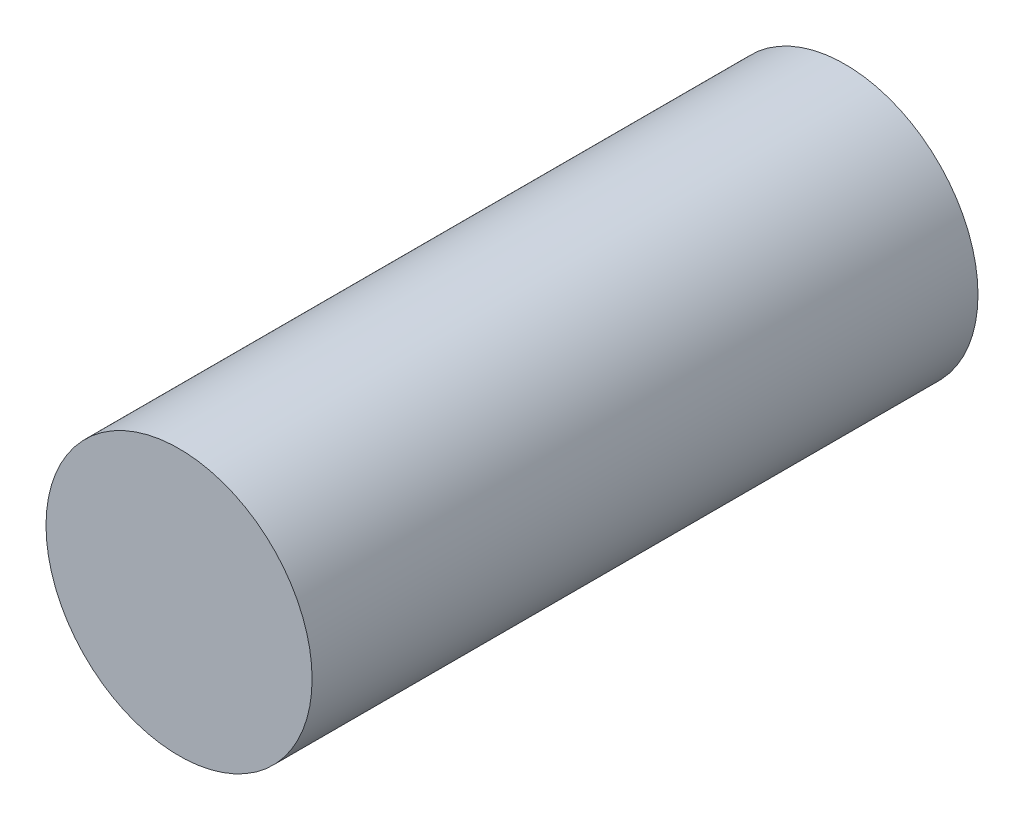
ISO-10303-21;
HEADER;
FILE_DESCRIPTION(('STEP AP214'),'2;1');
FILE_NAME('part.step','',(''),(''),'','','');
FILE_SCHEMA(('AUTOMOTIVE_DESIGN { 1 0 10303 214 1 1 1 1 }'));
ENDSEC;
DATA;
#1=APPLICATION_CONTEXT('core data for automotive mechanical design processes');
#2=APPLICATION_PROTOCOL_DEFINITION('international standard','automotive_design',2000,#1);
#3=PRODUCT_CONTEXT('',#1,'mechanical');
#4=PRODUCT('Part','Part','',(#3));
#5=PRODUCT_RELATED_PRODUCT_CATEGORY('part','',(#4));
#6=PRODUCT_DEFINITION_FORMATION('','',#4);
#7=PRODUCT_DEFINITION_CONTEXT('part definition',#1,'design');
#8=PRODUCT_DEFINITION('design','',#6,#7);
#9=PRODUCT_DEFINITION_SHAPE('','',#8);
#10=(LENGTH_UNIT() NAMED_UNIT(*) SI_UNIT(.MILLI.,.METRE.));
#11=(NAMED_UNIT(*) PLANE_ANGLE_UNIT() SI_UNIT($,.RADIAN.));
#12=(NAMED_UNIT(*) SI_UNIT($,.STERADIAN.) SOLID_ANGLE_UNIT());
#13=UNCERTAINTY_MEASURE_WITH_UNIT(LENGTH_MEASURE(1.E-05),#10,'distance_accuracy_value','');
#14=(GEOMETRIC_REPRESENTATION_CONTEXT(3) GLOBAL_UNCERTAINTY_ASSIGNED_CONTEXT((#13)) GLOBAL_UNIT_ASSIGNED_CONTEXT((#10,
#11,#12)) REPRESENTATION_CONTEXT('',''));
#15=CARTESIAN_POINT('',(0.,0.,0.));
#16=DIRECTION('',(0.,0.,1.));
#17=DIRECTION('',(1.,0.,0.));
#18=AXIS2_PLACEMENT_3D('',#15,#16,#17);
#19=CARTESIAN_POINT('',(0.1999996,0.,1.00099876));
#20=DIRECTION('',(0.,0.,-1.));
#21=DIRECTION('',(0.,-1.,0.));
#22=AXIS2_PLACEMENT_3D('',#19,#20,#21);
#23=PLANE('',#22);
#24=CARTESIAN_POINT('',(0.,0.,1.00099876));
#25=DIRECTION('',(0.,0.,1.));
#26=DIRECTION('',(1.,0.,0.));
#27=AXIS2_PLACEMENT_3D('',#24,#25,#26);
#28=CIRCLE('',#27,0.1999996);
#29=CARTESIAN_POINT('',(0.1999996,0.,1.00099876));
#30=VERTEX_POINT('',#29);
#31=EDGE_CURVE('E11',#30,#30,#28,.T.);
#32=ORIENTED_EDGE('',*,*,#31,.T.);
#33=EDGE_LOOP('',(#32));
#34=FACE_BOUND('',#33,.T.);
#35=ADVANCED_FACE('F17',(#34),#23,.F.);
#36=CARTESIAN_POINT('',(0.1999996,0.,0.));
#37=DIRECTION('',(0.,0.,-1.));
#38=DIRECTION('',(0.,-1.,0.));
#39=AXIS2_PLACEMENT_3D('',#36,#37,#38);
#40=PLANE('',#39);
#41=CARTESIAN_POINT('',(0.,0.,0.));
#42=DIRECTION('',(0.,0.,1.));
#43=DIRECTION('',(1.,0.,0.));
#44=AXIS2_PLACEMENT_3D('',#41,#42,#43);
#45=CIRCLE('',#44,0.1999996);
#46=CARTESIAN_POINT('',(0.1999996,0.,0.));
#47=VERTEX_POINT('',#46);
#48=EDGE_CURVE('E42',#47,#47,#45,.T.);
#49=ORIENTED_EDGE('',*,*,#48,.F.);
#50=EDGE_LOOP('',(#49));
#51=FACE_BOUND('',#50,.T.);
#52=ADVANCED_FACE('F61',(#51),#40,.T.);
#53=CARTESIAN_POINT('',(0.,0.,0.));
#54=DIRECTION('',(0.,0.,-1.));
#55=DIRECTION('',(1.,0.,0.));
#56=AXIS2_PLACEMENT_3D('',#53,#54,#55);
#57=CYLINDRICAL_SURFACE('',#56,0.1999996);
#58=ORIENTED_EDGE('',*,*,#48,.T.);
#59=DIRECTION('',(0.,0.,1.));
#60=VECTOR('',#59,1.);
#61=CARTESIAN_POINT('',(0.1999996,0.,0.));
#62=LINE('',#61,#60);
#63=EDGE_CURVE('E25',#47,#30,#62,.T.);
#64=ORIENTED_EDGE('',*,*,#63,.T.);
#65=ORIENTED_EDGE('',*,*,#31,.F.);
#66=ORIENTED_EDGE('',*,*,#63,.F.);
#67=EDGE_LOOP('',(#58,#64,#65,#66));
#68=FACE_BOUND('',#67,.T.);
#69=ADVANCED_FACE('F40',(#68),#57,.T.);
#70=CLOSED_SHELL('',(#35,#52,#69));
#71=MANIFOLD_SOLID_BREP('B1',#70);
#72=ADVANCED_BREP_SHAPE_REPRESENTATION('',(#18,#71),#14);
#73=SHAPE_DEFINITION_REPRESENTATION(#9,#72);
ENDSEC;
END-ISO-10303-21;
